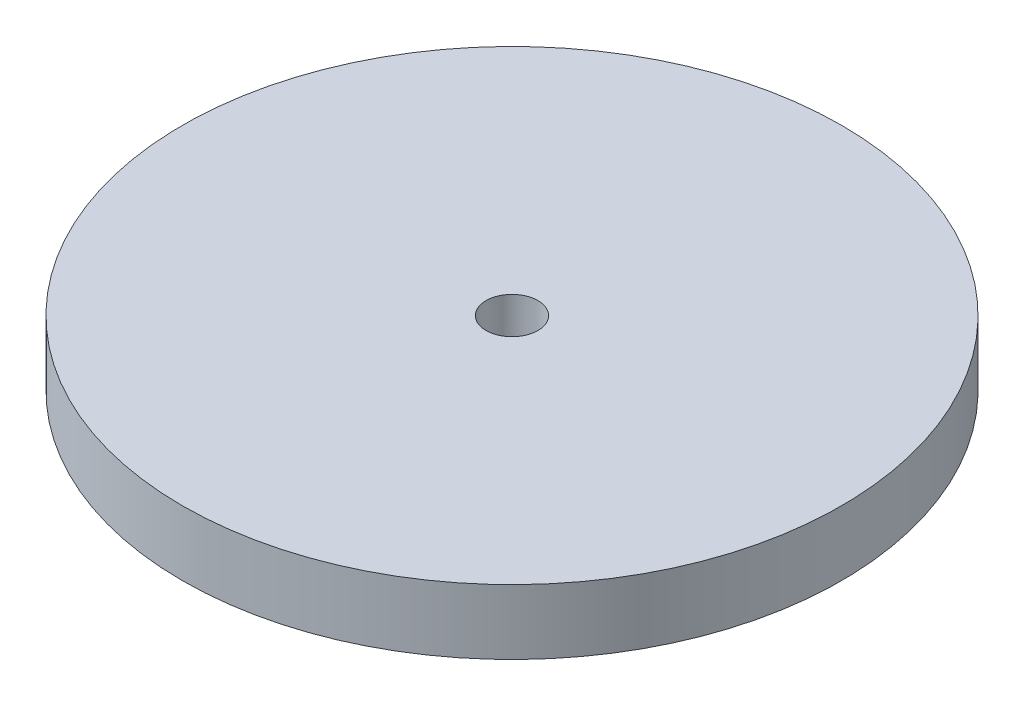
ISO-10303-21;
HEADER;
FILE_DESCRIPTION(('STEP AP214'),'2;1');
FILE_NAME('part.step','',(''),(''),'','','');
FILE_SCHEMA(('AUTOMOTIVE_DESIGN { 1 0 10303 214 1 1 1 1 }'));
ENDSEC;
DATA;
#1=APPLICATION_CONTEXT('core data for automotive mechanical design processes');
#2=APPLICATION_PROTOCOL_DEFINITION('international standard','automotive_design',2000,#1);
#3=PRODUCT_CONTEXT('',#1,'mechanical');
#4=PRODUCT('Part','Part','',(#3));
#5=PRODUCT_RELATED_PRODUCT_CATEGORY('part','',(#4));
#6=PRODUCT_DEFINITION_FORMATION('','',#4);
#7=PRODUCT_DEFINITION_CONTEXT('part definition',#1,'design');
#8=PRODUCT_DEFINITION('design','',#6,#7);
#9=PRODUCT_DEFINITION_SHAPE('','',#8);
#10=(LENGTH_UNIT() NAMED_UNIT(*) SI_UNIT(.MILLI.,.METRE.));
#11=(NAMED_UNIT(*) PLANE_ANGLE_UNIT() SI_UNIT($,.RADIAN.));
#12=(NAMED_UNIT(*) SI_UNIT($,.STERADIAN.) SOLID_ANGLE_UNIT());
#13=UNCERTAINTY_MEASURE_WITH_UNIT(LENGTH_MEASURE(1.E-05),#10,'distance_accuracy_value','');
#14=(GEOMETRIC_REPRESENTATION_CONTEXT(3) GLOBAL_UNCERTAINTY_ASSIGNED_CONTEXT((#13)) GLOBAL_UNIT_ASSIGNED_CONTEXT((#10,
#11,#12)) REPRESENTATION_CONTEXT('',''));
#15=CARTESIAN_POINT('',(0.,0.,0.));
#16=DIRECTION('',(0.,0.,1.));
#17=DIRECTION('',(1.,0.,0.));
#18=AXIS2_PLACEMENT_3D('',#15,#16,#17);
#19=CARTESIAN_POINT('',(0.,10.,0.));
#20=DIRECTION('',(0.,-1.,0.));
#21=DIRECTION('',(0.,0.,-1.));
#22=AXIS2_PLACEMENT_3D('',#19,#20,#21);
#23=CYLINDRICAL_SURFACE('',#22,50.8);
#24=CARTESIAN_POINT('',(0.,10.,0.));
#25=DIRECTION('',(0.,1.,0.));
#26=DIRECTION('',(0.,0.,1.));
#27=AXIS2_PLACEMENT_3D('',#24,#25,#26);
#28=CIRCLE('',#27,50.8);
#29=CARTESIAN_POINT('',(0.,10.,50.8));
#30=VERTEX_POINT('',#29);
#31=EDGE_CURVE('E10',#30,#30,#28,.T.);
#32=ORIENTED_EDGE('',*,*,#31,.F.);
#33=EDGE_LOOP('',(#32));
#34=FACE_BOUND('',#33,.T.);
#35=CARTESIAN_POINT('',(0.,0.,0.));
#36=DIRECTION('',(0.,1.,0.));
#37=DIRECTION('',(0.,0.,1.));
#38=AXIS2_PLACEMENT_3D('',#35,#36,#37);
#39=CIRCLE('',#38,50.8);
#40=CARTESIAN_POINT('',(0.,0.,50.8));
#41=VERTEX_POINT('',#40);
#42=EDGE_CURVE('E36',#41,#41,#39,.T.);
#43=ORIENTED_EDGE('',*,*,#42,.T.);
#44=EDGE_LOOP('',(#43));
#45=FACE_BOUND('',#44,.T.);
#46=ADVANCED_FACE('F33',(#34,#45),#23,.T.);
#47=CARTESIAN_POINT('',(0.,10.,0.));
#48=DIRECTION('',(0.,1.,0.));
#49=DIRECTION('',(0.,0.,1.));
#50=AXIS2_PLACEMENT_3D('',#47,#48,#49);
#51=PLANE('',#50);
#52=CARTESIAN_POINT('',(0.,10.,0.));
#53=DIRECTION('',(0.,1.,0.));
#54=DIRECTION('',(0.,0.,1.));
#55=AXIS2_PLACEMENT_3D('',#52,#53,#54);
#56=CIRCLE('',#55,4.);
#57=CARTESIAN_POINT('',(0.,10.,4.));
#58=VERTEX_POINT('',#57);
#59=EDGE_CURVE('E45',#58,#58,#56,.T.);
#60=ORIENTED_EDGE('',*,*,#59,.F.);
#61=EDGE_LOOP('',(#60));
#62=FACE_BOUND('',#61,.T.);
#63=ORIENTED_EDGE('',*,*,#31,.T.);
#64=EDGE_LOOP('',(#63));
#65=FACE_BOUND('',#64,.T.);
#66=ADVANCED_FACE('F60',(#62,#65),#51,.T.);
#67=CARTESIAN_POINT('',(0.,0.,0.));
#68=DIRECTION('',(0.,1.,0.));
#69=DIRECTION('',(0.,0.,1.));
#70=AXIS2_PLACEMENT_3D('',#67,#68,#69);
#71=PLANE('',#70);
#72=CARTESIAN_POINT('',(0.,0.,0.));
#73=DIRECTION('',(0.,1.,0.));
#74=DIRECTION('',(0.,0.,1.));
#75=AXIS2_PLACEMENT_3D('',#72,#73,#74);
#76=CIRCLE('',#75,4.);
#77=CARTESIAN_POINT('',(0.,0.,4.));
#78=VERTEX_POINT('',#77);
#79=EDGE_CURVE('E43',#78,#78,#76,.T.);
#80=ORIENTED_EDGE('',*,*,#79,.T.);
#81=EDGE_LOOP('',(#80));
#82=FACE_BOUND('',#81,.T.);
#83=ORIENTED_EDGE('',*,*,#42,.F.);
#84=EDGE_LOOP('',(#83));
#85=FACE_BOUND('',#84,.T.);
#86=ADVANCED_FACE('F51',(#82,#85),#71,.F.);
#87=CARTESIAN_POINT('',(0.,0.,0.));
#88=DIRECTION('',(0.,1.,0.));
#89=DIRECTION('',(0.,0.,1.));
#90=AXIS2_PLACEMENT_3D('',#87,#88,#89);
#91=CYLINDRICAL_SURFACE('',#90,4.);
#92=ORIENTED_EDGE('',*,*,#79,.F.);
#93=EDGE_LOOP('',(#92));
#94=FACE_BOUND('',#93,.T.);
#95=ORIENTED_EDGE('',*,*,#59,.T.);
#96=EDGE_LOOP('',(#95));
#97=FACE_BOUND('',#96,.T.);
#98=ADVANCED_FACE('F54',(#94,#97),#91,.F.);
#99=CLOSED_SHELL('',(#46,#66,#86,#98));
#100=MANIFOLD_SOLID_BREP('B2',#99);
#101=ADVANCED_BREP_SHAPE_REPRESENTATION('',(#18,#100),#14);
#102=SHAPE_DEFINITION_REPRESENTATION(#9,#101);
ENDSEC;
END-ISO-10303-21;
